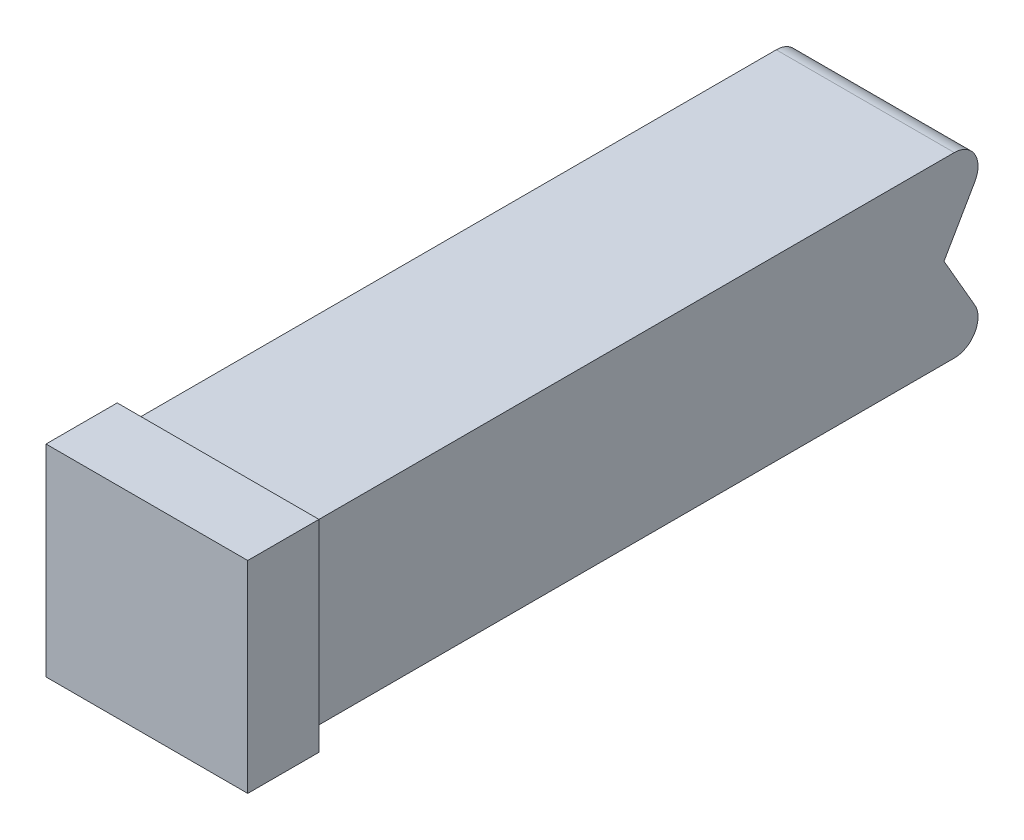
ISO-10303-21;
HEADER;
FILE_DESCRIPTION(('STEP AP214'),'2;1');
FILE_NAME('part.step','',(''),(''),'','','');
FILE_SCHEMA(('AUTOMOTIVE_DESIGN { 1 0 10303 214 1 1 1 1 }'));
ENDSEC;
DATA;
#1=APPLICATION_CONTEXT('core data for automotive mechanical design processes');
#2=APPLICATION_PROTOCOL_DEFINITION('international standard','automotive_design',2000,#1);
#3=PRODUCT_CONTEXT('',#1,'mechanical');
#4=PRODUCT('Part','Part','',(#3));
#5=PRODUCT_RELATED_PRODUCT_CATEGORY('part','',(#4));
#6=PRODUCT_DEFINITION_FORMATION('','',#4);
#7=PRODUCT_DEFINITION_CONTEXT('part definition',#1,'design');
#8=PRODUCT_DEFINITION('design','',#6,#7);
#9=PRODUCT_DEFINITION_SHAPE('','',#8);
#10=(LENGTH_UNIT() NAMED_UNIT(*) SI_UNIT(.MILLI.,.METRE.));
#11=(NAMED_UNIT(*) PLANE_ANGLE_UNIT() SI_UNIT($,.RADIAN.));
#12=(NAMED_UNIT(*) SI_UNIT($,.STERADIAN.) SOLID_ANGLE_UNIT());
#13=UNCERTAINTY_MEASURE_WITH_UNIT(LENGTH_MEASURE(1.E-05),#10,'distance_accuracy_value','');
#14=(GEOMETRIC_REPRESENTATION_CONTEXT(3) GLOBAL_UNCERTAINTY_ASSIGNED_CONTEXT((#13)) GLOBAL_UNIT_ASSIGNED_CONTEXT((#10,
#11,#12)) REPRESENTATION_CONTEXT('',''));
#15=CARTESIAN_POINT('',(0.,0.,0.));
#16=DIRECTION('',(0.,0.,1.));
#17=DIRECTION('',(1.,0.,0.));
#18=AXIS2_PLACEMENT_3D('',#15,#16,#17);
#19=CARTESIAN_POINT('',(0.5,1.5,-27.2679491924311));
#20=DIRECTION('',(1.,0.,0.));
#21=DIRECTION('',(0.,0.,-1.));
#22=AXIS2_PLACEMENT_3D('',#19,#20,#21);
#23=PLANE('',#22);
#24=DIRECTION('',(0.,-1.,0.));
#25=VECTOR('',#24,1.);
#26=CARTESIAN_POINT('',(0.5,0.,0.));
#27=LINE('',#26,#25);
#28=CARTESIAN_POINT('',(0.5,8.,0.));
#29=VERTEX_POINT('',#28);
#30=CARTESIAN_POINT('',(0.5,0.5,0.));
#31=VERTEX_POINT('',#30);
#32=EDGE_CURVE('E12',#29,#31,#27,.T.);
#33=ORIENTED_EDGE('',*,*,#32,.F.);
#34=DIRECTION('',(0.,0.,-1.));
#35=VECTOR('',#34,1.);
#36=CARTESIAN_POINT('',(0.5,8.,-26.8349364905389));
#37=LINE('',#36,#35);
#38=CARTESIAN_POINT('',(0.5,8.,-27.2679491924311));
#39=VERTEX_POINT('',#38);
#40=EDGE_CURVE('E182',#29,#39,#37,.T.);
#41=ORIENTED_EDGE('',*,*,#40,.T.);
#42=CARTESIAN_POINT('',(0.5,7.,-27.2679491924311));
#43=DIRECTION('',(-1.,0.,0.));
#44=DIRECTION('',(0.,0.,-1.));
#45=AXIS2_PLACEMENT_3D('',#42,#43,#44);
#46=CIRCLE('',#45,1.00000000000001);
#47=CARTESIAN_POINT('',(0.5,6.50000000000001,-28.1339745962156));
#48=VERTEX_POINT('',#47);
#49=EDGE_CURVE('E204',#39,#48,#46,.T.);
#50=ORIENTED_EDGE('',*,*,#49,.T.);
#51=DIRECTION('',(0.,-0.866025403784437,0.500000000000003));
#52=VECTOR('',#51,1.);
#53=CARTESIAN_POINT('',(0.5,4.99999999999996,-27.2679491924311));
#54=LINE('',#53,#52);
#55=CARTESIAN_POINT('',(0.5,4.24999999999999,-26.8349364905389));
#56=VERTEX_POINT('',#55);
#57=EDGE_CURVE('E207',#48,#56,#54,.T.);
#58=ORIENTED_EDGE('',*,*,#57,.T.);
#59=DIRECTION('',(0.,-0.866025403784436,-0.500000000000004));
#60=VECTOR('',#59,1.);
#61=CARTESIAN_POINT('',(0.5,1.99999999999999,-28.1339745962156));
#62=LINE('',#61,#60);
#63=CARTESIAN_POINT('',(0.5,1.99999999999999,-28.1339745962156));
#64=VERTEX_POINT('',#63);
#65=EDGE_CURVE('E209',#56,#64,#62,.T.);
#66=ORIENTED_EDGE('',*,*,#65,.T.);
#67=CARTESIAN_POINT('',(0.5,1.5,-27.2679491924311));
#68=DIRECTION('',(-1.,0.,0.));
#69=DIRECTION('',(0.,0.,-1.));
#70=AXIS2_PLACEMENT_3D('',#67,#68,#69);
#71=CIRCLE('',#70,1.00000000000001);
#72=CARTESIAN_POINT('',(0.5,0.5,-27.2679491924311));
#73=VERTEX_POINT('',#72);
#74=EDGE_CURVE('E201',#64,#73,#71,.T.);
#75=ORIENTED_EDGE('',*,*,#74,.T.);
#76=DIRECTION('',(0.,0.,-1.));
#77=VECTOR('',#76,1.);
#78=CARTESIAN_POINT('',(0.5,0.5,-26.8349364905389));
#79=LINE('',#78,#77);
#80=EDGE_CURVE('E188',#31,#73,#79,.T.);
#81=ORIENTED_EDGE('',*,*,#80,.F.);
#82=EDGE_LOOP('',(#33,#41,#50,#58,#66,#75,#81));
#83=FACE_BOUND('',#82,.T.);
#84=ADVANCED_FACE('F48',(#83),#23,.F.);
#85=CARTESIAN_POINT('',(8.5,8.5,0.));
#86=DIRECTION('',(0.,1.,0.));
#87=DIRECTION('',(-1.,0.,0.));
#88=AXIS2_PLACEMENT_3D('',#85,#86,#87);
#89=PLANE('',#88);
#90=DIRECTION('',(0.,0.,1.));
#91=VECTOR('',#90,1.);
#92=CARTESIAN_POINT('',(8.5,8.5,0.));
#93=LINE('',#92,#91);
#94=CARTESIAN_POINT('',(8.5,8.5,3.));
#95=VERTEX_POINT('',#94);
#96=CARTESIAN_POINT('',(8.5,8.5,0.));
#97=VERTEX_POINT('',#96);
#98=EDGE_CURVE('E147',#95,#97,#93,.F.);
#99=ORIENTED_EDGE('',*,*,#98,.T.);
#100=DIRECTION('',(1.,0.,0.));
#101=VECTOR('',#100,1.);
#102=CARTESIAN_POINT('',(0.5,8.5,0.));
#103=LINE('',#102,#101);
#104=CARTESIAN_POINT('',(0.,8.5,0.));
#105=VERTEX_POINT('',#104);
#106=EDGE_CURVE('E141',#105,#97,#103,.T.);
#107=ORIENTED_EDGE('',*,*,#106,.F.);
#108=DIRECTION('',(0.,0.,-1.));
#109=VECTOR('',#108,1.);
#110=CARTESIAN_POINT('',(0.,8.5,0.));
#111=LINE('',#110,#109);
#112=CARTESIAN_POINT('',(0.,8.5,3.));
#113=VERTEX_POINT('',#112);
#114=EDGE_CURVE('E145',#113,#105,#111,.T.);
#115=ORIENTED_EDGE('',*,*,#114,.F.);
#116=DIRECTION('',(-1.,0.,0.));
#117=VECTOR('',#116,1.);
#118=CARTESIAN_POINT('',(8.5,8.5,3.));
#119=LINE('',#118,#117);
#120=EDGE_CURVE('E65',#113,#95,#119,.F.);
#121=ORIENTED_EDGE('',*,*,#120,.T.);
#122=EDGE_LOOP('',(#99,#107,#115,#121));
#123=FACE_BOUND('',#122,.T.);
#124=ADVANCED_FACE('F143',(#123),#89,.T.);
#125=CARTESIAN_POINT('',(8.5,0.,0.));
#126=DIRECTION('',(1.,0.,0.));
#127=DIRECTION('',(0.,0.,-1.));
#128=AXIS2_PLACEMENT_3D('',#125,#126,#127);
#129=PLANE('',#128);
#130=DIRECTION('',(0.,0.,1.));
#131=VECTOR('',#130,1.);
#132=CARTESIAN_POINT('',(8.5,0.,3.));
#133=LINE('',#132,#131);
#134=CARTESIAN_POINT('',(8.5,0.,0.));
#135=VERTEX_POINT('',#134);
#136=CARTESIAN_POINT('',(8.5,0.,3.));
#137=VERTEX_POINT('',#136);
#138=EDGE_CURVE('E194',#135,#137,#133,.T.);
#139=ORIENTED_EDGE('',*,*,#138,.F.);
#140=DIRECTION('',(0.,-1.,0.));
#141=VECTOR('',#140,1.);
#142=CARTESIAN_POINT('',(8.5,8.5,0.));
#143=LINE('',#142,#141);
#144=EDGE_CURVE('E150',#97,#135,#143,.T.);
#145=ORIENTED_EDGE('',*,*,#144,.F.);
#146=ORIENTED_EDGE('',*,*,#98,.F.);
#147=DIRECTION('',(0.,1.,0.));
#148=VECTOR('',#147,1.);
#149=CARTESIAN_POINT('',(8.5,0.,3.));
#150=LINE('',#149,#148);
#151=EDGE_CURVE('E217',#95,#137,#150,.F.);
#152=ORIENTED_EDGE('',*,*,#151,.T.);
#153=EDGE_LOOP('',(#139,#145,#146,#152));
#154=FACE_BOUND('',#153,.T.);
#155=ADVANCED_FACE('F434',(#154),#129,.T.);
#156=CARTESIAN_POINT('',(0.,0.,0.));
#157=DIRECTION('',(0.,1.,0.));
#158=DIRECTION('',(0.,0.,1.));
#159=AXIS2_PLACEMENT_3D('',#156,#157,#158);
#160=PLANE('',#159);
#161=DIRECTION('',(-1.,0.,0.));
#162=VECTOR('',#161,1.);
#163=CARTESIAN_POINT('',(8.5,0.,0.));
#164=LINE('',#163,#162);
#165=CARTESIAN_POINT('',(0.,0.,0.));
#166=VERTEX_POINT('',#165);
#167=EDGE_CURVE('E158',#135,#166,#164,.T.);
#168=ORIENTED_EDGE('',*,*,#167,.F.);
#169=ORIENTED_EDGE('',*,*,#138,.T.);
#170=DIRECTION('',(-1.,0.,0.));
#171=VECTOR('',#170,1.);
#172=CARTESIAN_POINT('',(0.5,0.,3.));
#173=LINE('',#172,#171);
#174=CARTESIAN_POINT('',(0.,0.,3.));
#175=VERTEX_POINT('',#174);
#176=EDGE_CURVE('E196',#137,#175,#173,.T.);
#177=ORIENTED_EDGE('',*,*,#176,.T.);
#178=DIRECTION('',(0.,0.,1.));
#179=VECTOR('',#178,1.);
#180=CARTESIAN_POINT('',(0.,0.,3.));
#181=LINE('',#180,#179);
#182=EDGE_CURVE('E162',#166,#175,#181,.T.);
#183=ORIENTED_EDGE('',*,*,#182,.F.);
#184=EDGE_LOOP('',(#168,#169,#177,#183));
#185=FACE_BOUND('',#184,.T.);
#186=ADVANCED_FACE('F437',(#185),#160,.F.);
#187=CARTESIAN_POINT('',(8.,0.5,-29.));
#188=DIRECTION('',(0.,-0.500000000000003,0.866025403784437));
#189=DIRECTION('',(0.,-0.866025403784437,-0.500000000000003));
#190=AXIS2_PLACEMENT_3D('',#187,#188,#189);
#191=PLANE('',#190);
#192=DIRECTION('',(0.,0.86602540378443,0.500000000000014));
#193=VECTOR('',#192,1.);
#194=CARTESIAN_POINT('',(8.,2.00000000000001,-28.1339745962156));
#195=LINE('',#194,#193);
#196=CARTESIAN_POINT('',(8.,2.00000000000001,-28.1339745962156));
#197=VERTEX_POINT('',#196);
#198=CARTESIAN_POINT('',(8.,4.24999999999999,-26.8349364905389));
#199=VERTEX_POINT('',#198);
#200=EDGE_CURVE('E199',#197,#199,#195,.T.);
#201=ORIENTED_EDGE('',*,*,#200,.F.);
#202=DIRECTION('',(1.,0.,0.));
#203=VECTOR('',#202,1.);
#204=CARTESIAN_POINT('',(8.,1.99999999999998,-28.1339745962156));
#205=LINE('',#204,#203);
#206=EDGE_CURVE('E52',#64,#197,#205,.T.);
#207=ORIENTED_EDGE('',*,*,#206,.F.);
#208=ORIENTED_EDGE('',*,*,#65,.F.);
#209=DIRECTION('',(-1.,0.,0.));
#210=VECTOR('',#209,1.);
#211=CARTESIAN_POINT('',(8.,4.24999999999999,-26.8349364905389));
#212=LINE('',#211,#210);
#213=EDGE_CURVE('E185',#199,#56,#212,.T.);
#214=ORIENTED_EDGE('',*,*,#213,.F.);
#215=EDGE_LOOP('',(#201,#207,#208,#214));
#216=FACE_BOUND('',#215,.T.);
#217=ADVANCED_FACE('F412',(#216),#191,.F.);
#218=CARTESIAN_POINT('',(8.,1.5,-27.2679491924311));
#219=DIRECTION('',(-1.,0.,0.));
#220=DIRECTION('',(0.,0.,1.));
#221=AXIS2_PLACEMENT_3D('',#218,#219,#220);
#222=CYLINDRICAL_SURFACE('',#221,1.);
#223=ORIENTED_EDGE('',*,*,#206,.T.);
#224=CARTESIAN_POINT('',(8.,1.5,-27.2679491924311));
#225=DIRECTION('',(1.,0.,0.));
#226=DIRECTION('',(0.,0.,-1.));
#227=AXIS2_PLACEMENT_3D('',#224,#225,#226);
#228=CIRCLE('',#227,1.00000000000002);
#229=CARTESIAN_POINT('',(8.,0.5,-27.2679491924311));
#230=VERTEX_POINT('',#229);
#231=EDGE_CURVE('E93',#230,#197,#228,.T.);
#232=ORIENTED_EDGE('',*,*,#231,.F.);
#233=DIRECTION('',(1.,0.,0.));
#234=VECTOR('',#233,1.);
#235=CARTESIAN_POINT('',(8.,0.5,-27.2679491924311));
#236=LINE('',#235,#234);
#237=EDGE_CURVE('E220',#73,#230,#236,.T.);
#238=ORIENTED_EDGE('',*,*,#237,.F.);
#239=ORIENTED_EDGE('',*,*,#74,.F.);
#240=EDGE_LOOP('',(#223,#232,#238,#239));
#241=FACE_BOUND('',#240,.T.);
#242=ADVANCED_FACE('F406',(#241),#222,.T.);
#243=CARTESIAN_POINT('',(4.25,4.25,3.));
#244=DIRECTION('',(0.,0.,1.));
#245=DIRECTION('',(1.,0.,0.));
#246=AXIS2_PLACEMENT_3D('',#243,#244,#245);
#247=PLANE('',#246);
#248=ORIENTED_EDGE('',*,*,#120,.F.);
#249=DIRECTION('',(0.,1.,0.));
#250=VECTOR('',#249,1.);
#251=CARTESIAN_POINT('',(0.,8.5,3.));
#252=LINE('',#251,#250);
#253=EDGE_CURVE('E167',#175,#113,#252,.T.);
#254=ORIENTED_EDGE('',*,*,#253,.F.);
#255=ORIENTED_EDGE('',*,*,#176,.F.);
#256=ORIENTED_EDGE('',*,*,#151,.F.);
#257=EDGE_LOOP('',(#248,#254,#255,#256));
#258=FACE_BOUND('',#257,.T.);
#259=ADVANCED_FACE('F50',(#258),#247,.T.);
#260=CARTESIAN_POINT('',(0.5,7.,-27.2679491924311));
#261=DIRECTION('',(1.,0.,0.));
#262=DIRECTION('',(0.,0.,-1.));
#263=AXIS2_PLACEMENT_3D('',#260,#261,#262);
#264=CYLINDRICAL_SURFACE('',#263,1.00000000000001);
#265=CARTESIAN_POINT('',(8.,7.,-27.2679491924311));
#266=DIRECTION('',(-1.,0.,0.));
#267=DIRECTION('',(0.,0.,-1.));
#268=AXIS2_PLACEMENT_3D('',#265,#266,#267);
#269=CIRCLE('',#268,1.00000000000001);
#270=CARTESIAN_POINT('',(8.,8.,-27.2679491924311));
#271=VERTEX_POINT('',#270);
#272=CARTESIAN_POINT('',(8.,6.50000000000001,-28.1339745962156));
#273=VERTEX_POINT('',#272);
#274=EDGE_CURVE('E85',#271,#273,#269,.T.);
#275=ORIENTED_EDGE('',*,*,#274,.T.);
#276=DIRECTION('',(1.,0.,0.));
#277=VECTOR('',#276,1.);
#278=CARTESIAN_POINT('',(0.5,6.50000000000001,-28.1339745962156));
#279=LINE('',#278,#277);
#280=EDGE_CURVE('E211',#48,#273,#279,.T.);
#281=ORIENTED_EDGE('',*,*,#280,.F.);
#282=ORIENTED_EDGE('',*,*,#49,.F.);
#283=DIRECTION('',(1.,0.,0.));
#284=VECTOR('',#283,1.);
#285=CARTESIAN_POINT('',(0.5,8.,-27.2679491924311));
#286=LINE('',#285,#284);
#287=EDGE_CURVE('E215',#39,#271,#286,.T.);
#288=ORIENTED_EDGE('',*,*,#287,.T.);
#289=EDGE_LOOP('',(#275,#281,#282,#288));
#290=FACE_BOUND('',#289,.T.);
#291=ADVANCED_FACE('F427',(#290),#264,.T.);
#292=CARTESIAN_POINT('',(0.5,4.99999999999996,-27.2679491924311));
#293=DIRECTION('',(0.,0.500000000000003,0.866025403784437));
#294=DIRECTION('',(0.,-0.866025403784437,0.500000000000003));
#295=AXIS2_PLACEMENT_3D('',#292,#293,#294);
#296=PLANE('',#295);
#297=DIRECTION('',(0.,-0.866025403784437,0.500000000000003));
#298=VECTOR('',#297,1.);
#299=CARTESIAN_POINT('',(8.,4.99999999999996,-27.2679491924311));
#300=LINE('',#299,#298);
#301=EDGE_CURVE('E205',#273,#199,#300,.T.);
#302=ORIENTED_EDGE('',*,*,#301,.T.);
#303=ORIENTED_EDGE('',*,*,#213,.T.);
#304=ORIENTED_EDGE('',*,*,#57,.F.);
#305=ORIENTED_EDGE('',*,*,#280,.T.);
#306=EDGE_LOOP('',(#302,#303,#304,#305));
#307=FACE_BOUND('',#306,.T.);
#308=ADVANCED_FACE('F414',(#307),#296,.F.);
#309=CARTESIAN_POINT('',(8.,1.5,-27.2679491924311));
#310=DIRECTION('',(1.,0.,0.));
#311=DIRECTION('',(0.,0.,-1.));
#312=AXIS2_PLACEMENT_3D('',#309,#310,#311);
#313=PLANE('',#312);
#314=ORIENTED_EDGE('',*,*,#274,.F.);
#315=DIRECTION('',(0.,0.,-1.));
#316=VECTOR('',#315,1.);
#317=CARTESIAN_POINT('',(8.,8.,-26.8349364905389));
#318=LINE('',#317,#316);
#319=CARTESIAN_POINT('',(8.,8.,0.));
#320=VERTEX_POINT('',#319);
#321=EDGE_CURVE('E183',#320,#271,#318,.T.);
#322=ORIENTED_EDGE('',*,*,#321,.F.);
#323=DIRECTION('',(0.,1.,0.));
#324=VECTOR('',#323,1.);
#325=CARTESIAN_POINT('',(8.,0.5,0.));
#326=LINE('',#325,#324);
#327=CARTESIAN_POINT('',(8.,0.5,0.));
#328=VERTEX_POINT('',#327);
#329=EDGE_CURVE('E179',#328,#320,#326,.T.);
#330=ORIENTED_EDGE('',*,*,#329,.F.);
#331=DIRECTION('',(0.,0.,-1.));
#332=VECTOR('',#331,1.);
#333=CARTESIAN_POINT('',(8.,0.5,-26.8349364905389));
#334=LINE('',#333,#332);
#335=EDGE_CURVE('E186',#328,#230,#334,.T.);
#336=ORIENTED_EDGE('',*,*,#335,.T.);
#337=ORIENTED_EDGE('',*,*,#231,.T.);
#338=ORIENTED_EDGE('',*,*,#200,.T.);
#339=ORIENTED_EDGE('',*,*,#301,.F.);
#340=EDGE_LOOP('',(#314,#322,#330,#336,#337,#338,#339));
#341=FACE_BOUND('',#340,.T.);
#342=ADVANCED_FACE('F416',(#341),#313,.T.);
#343=CARTESIAN_POINT('',(8.,8.,-26.8349364905389));
#344=DIRECTION('',(0.,-1.,0.));
#345=DIRECTION('',(0.,0.,-1.));
#346=AXIS2_PLACEMENT_3D('',#343,#344,#345);
#347=PLANE('',#346);
#348=ORIENTED_EDGE('',*,*,#287,.F.);
#349=ORIENTED_EDGE('',*,*,#40,.F.);
#350=DIRECTION('',(-1.,0.,0.));
#351=VECTOR('',#350,1.);
#352=CARTESIAN_POINT('',(8.,8.,0.));
#353=LINE('',#352,#351);
#354=EDGE_CURVE('E151',#320,#29,#353,.T.);
#355=ORIENTED_EDGE('',*,*,#354,.F.);
#356=ORIENTED_EDGE('',*,*,#321,.T.);
#357=EDGE_LOOP('',(#348,#349,#355,#356));
#358=FACE_BOUND('',#357,.T.);
#359=ADVANCED_FACE('F418',(#358),#347,.F.);
#360=CARTESIAN_POINT('',(0.5,0.5,-26.8349364905389));
#361=DIRECTION('',(0.,1.,0.));
#362=DIRECTION('',(-1.,0.,0.));
#363=AXIS2_PLACEMENT_3D('',#360,#361,#362);
#364=PLANE('',#363);
#365=ORIENTED_EDGE('',*,*,#237,.T.);
#366=ORIENTED_EDGE('',*,*,#335,.F.);
#367=DIRECTION('',(1.,0.,0.));
#368=VECTOR('',#367,1.);
#369=CARTESIAN_POINT('',(0.5,0.5,0.));
#370=LINE('',#369,#368);
#371=EDGE_CURVE('E176',#31,#328,#370,.T.);
#372=ORIENTED_EDGE('',*,*,#371,.F.);
#373=ORIENTED_EDGE('',*,*,#80,.T.);
#374=EDGE_LOOP('',(#365,#366,#372,#373));
#375=FACE_BOUND('',#374,.T.);
#376=ADVANCED_FACE('F424',(#375),#364,.F.);
#377=CARTESIAN_POINT('',(0.,0.,0.));
#378=DIRECTION('',(0.,0.,-1.));
#379=DIRECTION('',(-1.,0.,0.));
#380=AXIS2_PLACEMENT_3D('',#377,#378,#379);
#381=PLANE('',#380);
#382=DIRECTION('',(0.,-1.,0.));
#383=VECTOR('',#382,1.);
#384=CARTESIAN_POINT('',(0.,0.,0.));
#385=LINE('',#384,#383);
#386=EDGE_CURVE('E154',#105,#166,#385,.T.);
#387=ORIENTED_EDGE('',*,*,#386,.F.);
#388=ORIENTED_EDGE('',*,*,#106,.T.);
#389=ORIENTED_EDGE('',*,*,#144,.T.);
#390=ORIENTED_EDGE('',*,*,#167,.T.);
#391=EDGE_LOOP('',(#387,#388,#389,#390));
#392=FACE_BOUND('',#391,.T.);
#393=ORIENTED_EDGE('',*,*,#354,.T.);
#394=ORIENTED_EDGE('',*,*,#32,.T.);
#395=ORIENTED_EDGE('',*,*,#371,.T.);
#396=ORIENTED_EDGE('',*,*,#329,.T.);
#397=EDGE_LOOP('',(#393,#394,#395,#396));
#398=FACE_BOUND('',#397,.T.);
#399=ADVANCED_FACE('F155',(#392,#398),#381,.T.);
#400=CARTESIAN_POINT('',(0.,0.,0.));
#401=DIRECTION('',(1.,0.,0.));
#402=DIRECTION('',(0.,0.,-1.));
#403=AXIS2_PLACEMENT_3D('',#400,#401,#402);
#404=PLANE('',#403);
#405=ORIENTED_EDGE('',*,*,#114,.T.);
#406=ORIENTED_EDGE('',*,*,#386,.T.);
#407=ORIENTED_EDGE('',*,*,#182,.T.);
#408=ORIENTED_EDGE('',*,*,#253,.T.);
#409=EDGE_LOOP('',(#405,#406,#407,#408));
#410=FACE_BOUND('',#409,.T.);
#411=ADVANCED_FACE('F165',(#410),#404,.F.);
#412=CLOSED_SHELL('',(#84,#124,#155,#186,#217,#242,#259,#291,#308,#342,#359,#376,#399,#411));
#413=MANIFOLD_SOLID_BREP('B2',#412);
#414=ADVANCED_BREP_SHAPE_REPRESENTATION('',(#18,#413),#14);
#415=SHAPE_DEFINITION_REPRESENTATION(#9,#414);
ENDSEC;
END-ISO-10303-21;
